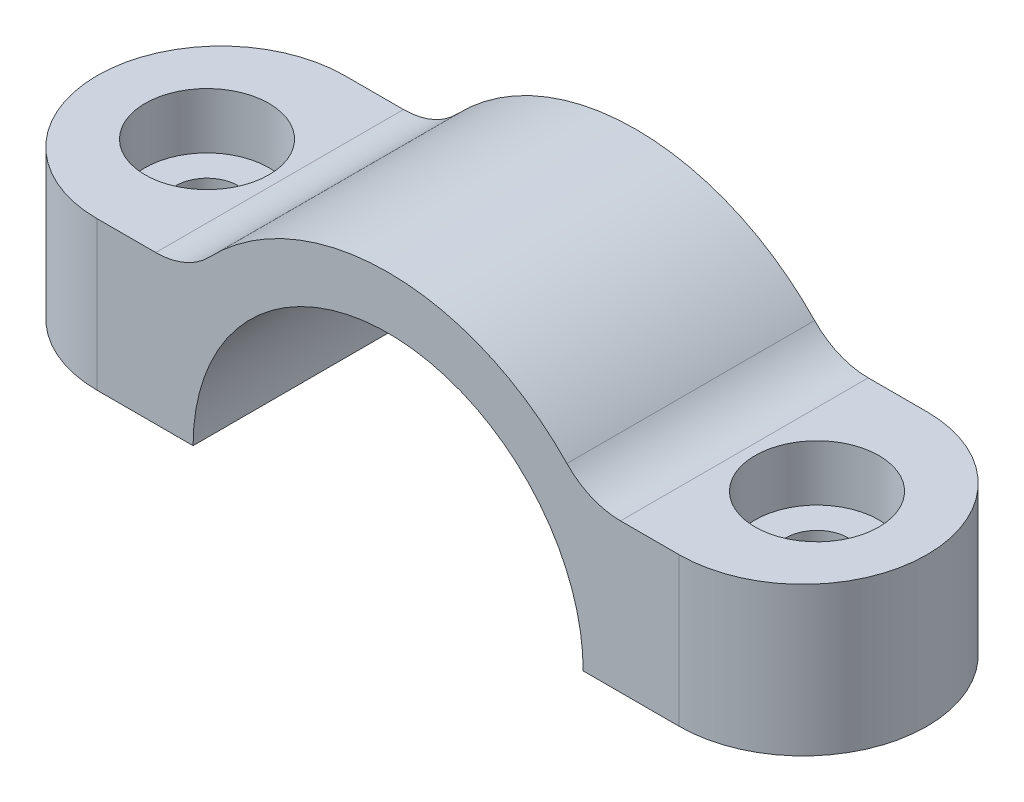
ISO-10303-21;
HEADER;
FILE_DESCRIPTION(('STEP AP214'),'2;1');
FILE_NAME('part.step','',(''),(''),'','','');
FILE_SCHEMA(('AUTOMOTIVE_DESIGN { 1 0 10303 214 1 1 1 1 }'));
ENDSEC;
DATA;
#1=APPLICATION_CONTEXT('core data for automotive mechanical design processes');
#2=APPLICATION_PROTOCOL_DEFINITION('international standard','automotive_design',2000,#1);
#3=PRODUCT_CONTEXT('',#1,'mechanical');
#4=PRODUCT('Part','Part','',(#3));
#5=PRODUCT_RELATED_PRODUCT_CATEGORY('part','',(#4));
#6=PRODUCT_DEFINITION_FORMATION('','',#4);
#7=PRODUCT_DEFINITION_CONTEXT('part definition',#1,'design');
#8=PRODUCT_DEFINITION('design','',#6,#7);
#9=PRODUCT_DEFINITION_SHAPE('','',#8);
#10=(LENGTH_UNIT() NAMED_UNIT(*) SI_UNIT(.MILLI.,.METRE.));
#11=(NAMED_UNIT(*) PLANE_ANGLE_UNIT() SI_UNIT($,.RADIAN.));
#12=(NAMED_UNIT(*) SI_UNIT($,.STERADIAN.) SOLID_ANGLE_UNIT());
#13=UNCERTAINTY_MEASURE_WITH_UNIT(LENGTH_MEASURE(1.E-05),#10,'distance_accuracy_value','');
#14=(GEOMETRIC_REPRESENTATION_CONTEXT(3) GLOBAL_UNCERTAINTY_ASSIGNED_CONTEXT((#13)) GLOBAL_UNIT_ASSIGNED_CONTEXT((#10,
#11,#12)) REPRESENTATION_CONTEXT('',''));
#15=CARTESIAN_POINT('',(0.,0.,0.));
#16=DIRECTION('',(0.,0.,1.));
#17=DIRECTION('',(1.,0.,0.));
#18=AXIS2_PLACEMENT_3D('',#15,#16,#17);
#19=CARTESIAN_POINT('',(0.,0.,12.7));
#20=DIRECTION('',(0.,0.,1.));
#21=DIRECTION('',(1.,0.,0.));
#22=AXIS2_PLACEMENT_3D('',#19,#20,#21);
#23=PLANE('',#22);
#24=DIRECTION('',(0.,-1.,0.));
#25=VECTOR('',#24,1.);
#26=CARTESIAN_POINT('',(-29.845,25.4,12.7));
#27=LINE('',#26,#25);
#28=CARTESIAN_POINT('',(-29.845,15.24,12.7));
#29=VERTEX_POINT('',#28);
#30=CARTESIAN_POINT('',(-29.845,0.,12.7));
#31=VERTEX_POINT('',#30);
#32=EDGE_CURVE('E112',#29,#31,#27,.T.);
#33=ORIENTED_EDGE('',*,*,#32,.T.);
#34=DIRECTION('',(1.,0.,0.));
#35=VECTOR('',#34,1.);
#36=CARTESIAN_POINT('',(-42.545,0.,12.7));
#37=LINE('',#36,#35);
#38=CARTESIAN_POINT('',(-20.,0.,12.7));
#39=VERTEX_POINT('',#38);
#40=EDGE_CURVE('E120',#31,#39,#37,.T.);
#41=ORIENTED_EDGE('',*,*,#40,.T.);
#42=CARTESIAN_POINT('',(0.,0.,12.7));
#43=DIRECTION('',(0.,0.,-1.));
#44=DIRECTION('',(1.,0.,0.));
#45=AXIS2_PLACEMENT_3D('',#42,#43,#44);
#46=CIRCLE('',#45,20.);
#47=CARTESIAN_POINT('',(20.,0.,12.7));
#48=VERTEX_POINT('',#47);
#49=EDGE_CURVE('E131',#39,#48,#46,.T.);
#50=ORIENTED_EDGE('',*,*,#49,.T.);
#51=DIRECTION('',(1.,0.,0.));
#52=VECTOR('',#51,1.);
#53=CARTESIAN_POINT('',(42.545,0.,12.7));
#54=LINE('',#53,#52);
#55=CARTESIAN_POINT('',(29.845,0.,12.7));
#56=VERTEX_POINT('',#55);
#57=EDGE_CURVE('E134',#48,#56,#54,.T.);
#58=ORIENTED_EDGE('',*,*,#57,.T.);
#59=DIRECTION('',(0.,-1.,0.));
#60=VECTOR('',#59,1.);
#61=CARTESIAN_POINT('',(29.845,25.4,12.7));
#62=LINE('',#61,#60);
#63=CARTESIAN_POINT('',(29.845,15.24,12.7));
#64=VERTEX_POINT('',#63);
#65=EDGE_CURVE('E125',#64,#56,#62,.T.);
#66=ORIENTED_EDGE('',*,*,#65,.F.);
#67=DIRECTION('',(-1.,0.,0.));
#68=VECTOR('',#67,1.);
#69=CARTESIAN_POINT('',(42.545,15.24,12.7));
#70=LINE('',#69,#68);
#71=CARTESIAN_POINT('',(23.827312059903,15.24,12.7));
#72=VERTEX_POINT('',#71);
#73=EDGE_CURVE('E145',#64,#72,#70,.T.);
#74=ORIENTED_EDGE('',*,*,#73,.T.);
#75=CARTESIAN_POINT('',(23.827312059903,22.86,12.7));
#76=DIRECTION('',(0.,0.,1.));
#77=DIRECTION('',(1.,0.,0.));
#78=AXIS2_PLACEMENT_3D('',#75,#76,#77);
#79=CIRCLE('',#78,7.62);
#80=CARTESIAN_POINT('',(18.3287015845408,17.5846153846154,12.7));
#81=VERTEX_POINT('',#80);
#82=EDGE_CURVE('E173',#72,#81,#79,.F.);
#83=ORIENTED_EDGE('',*,*,#82,.T.);
#84=CARTESIAN_POINT('',(0.,0.,12.7));
#85=DIRECTION('',(0.,0.,1.));
#86=DIRECTION('',(1.,0.,0.));
#87=AXIS2_PLACEMENT_3D('',#84,#85,#86);
#88=CIRCLE('',#87,25.4);
#89=CARTESIAN_POINT('',(-18.3287015845408,17.5846153846154,12.7));
#90=VERTEX_POINT('',#89);
#91=EDGE_CURVE('E147',#81,#90,#88,.T.);
#92=ORIENTED_EDGE('',*,*,#91,.T.);
#93=CARTESIAN_POINT('',(-23.827312059903,22.86,12.7));
#94=DIRECTION('',(0.,0.,1.));
#95=DIRECTION('',(1.,0.,0.));
#96=AXIS2_PLACEMENT_3D('',#93,#94,#95);
#97=CIRCLE('',#96,7.62);
#98=CARTESIAN_POINT('',(-23.827312059903,15.24,12.7));
#99=VERTEX_POINT('',#98);
#100=EDGE_CURVE('E12',#90,#99,#97,.F.);
#101=ORIENTED_EDGE('',*,*,#100,.T.);
#102=DIRECTION('',(-1.,0.,0.));
#103=VECTOR('',#102,1.);
#104=CARTESIAN_POINT('',(-42.545,15.24,12.7));
#105=LINE('',#104,#103);
#106=EDGE_CURVE('E123',#99,#29,#105,.T.);
#107=ORIENTED_EDGE('',*,*,#106,.T.);
#108=EDGE_LOOP('',(#33,#41,#50,#58,#66,#74,#83,#92,#101,#107));
#109=FACE_BOUND('',#108,.T.);
#110=ADVANCED_FACE('F35',(#109),#23,.T.);
#111=CARTESIAN_POINT('',(0.,0.,-12.7));
#112=DIRECTION('',(0.,0.,1.));
#113=DIRECTION('',(1.,0.,0.));
#114=AXIS2_PLACEMENT_3D('',#111,#112,#113);
#115=PLANE('',#114);
#116=DIRECTION('',(1.,0.,0.));
#117=VECTOR('',#116,1.);
#118=CARTESIAN_POINT('',(-42.545,0.,-12.7));
#119=LINE('',#118,#117);
#120=CARTESIAN_POINT('',(-29.845,0.,-12.7));
#121=VERTEX_POINT('',#120);
#122=CARTESIAN_POINT('',(-20.,0.,-12.7));
#123=VERTEX_POINT('',#122);
#124=EDGE_CURVE('E151',#121,#123,#119,.T.);
#125=ORIENTED_EDGE('',*,*,#124,.F.);
#126=DIRECTION('',(0.,-1.,0.));
#127=VECTOR('',#126,1.);
#128=CARTESIAN_POINT('',(-29.845,25.4,-12.7));
#129=LINE('',#128,#127);
#130=CARTESIAN_POINT('',(-29.845,15.24,-12.7));
#131=VERTEX_POINT('',#130);
#132=EDGE_CURVE('E114',#131,#121,#129,.T.);
#133=ORIENTED_EDGE('',*,*,#132,.F.);
#134=DIRECTION('',(-1.,0.,0.));
#135=VECTOR('',#134,1.);
#136=CARTESIAN_POINT('',(-42.545,15.24,-12.7));
#137=LINE('',#136,#135);
#138=CARTESIAN_POINT('',(-23.827312059903,15.24,-12.7));
#139=VERTEX_POINT('',#138);
#140=EDGE_CURVE('E132',#139,#131,#137,.T.);
#141=ORIENTED_EDGE('',*,*,#140,.F.);
#142=CARTESIAN_POINT('',(-23.827312059903,22.86,-12.7));
#143=DIRECTION('',(0.,0.,1.));
#144=DIRECTION('',(1.,0.,0.));
#145=AXIS2_PLACEMENT_3D('',#142,#143,#144);
#146=CIRCLE('',#145,7.62);
#147=CARTESIAN_POINT('',(-18.3287015845408,17.5846153846154,-12.7));
#148=VERTEX_POINT('',#147);
#149=EDGE_CURVE('E43',#139,#148,#146,.T.);
#150=ORIENTED_EDGE('',*,*,#149,.T.);
#151=CARTESIAN_POINT('',(0.,0.,-12.7));
#152=DIRECTION('',(0.,0.,1.));
#153=DIRECTION('',(1.,0.,0.));
#154=AXIS2_PLACEMENT_3D('',#151,#152,#153);
#155=CIRCLE('',#154,25.4);
#156=CARTESIAN_POINT('',(18.3287015845408,17.5846153846154,-12.7));
#157=VERTEX_POINT('',#156);
#158=EDGE_CURVE('E137',#157,#148,#155,.T.);
#159=ORIENTED_EDGE('',*,*,#158,.F.);
#160=CARTESIAN_POINT('',(23.827312059903,22.86,-12.7));
#161=DIRECTION('',(0.,0.,1.));
#162=DIRECTION('',(1.,0.,0.));
#163=AXIS2_PLACEMENT_3D('',#160,#161,#162);
#164=CIRCLE('',#163,7.62);
#165=CARTESIAN_POINT('',(23.827312059903,15.24,-12.7));
#166=VERTEX_POINT('',#165);
#167=EDGE_CURVE('E170',#157,#166,#164,.T.);
#168=ORIENTED_EDGE('',*,*,#167,.T.);
#169=DIRECTION('',(-1.,0.,0.));
#170=VECTOR('',#169,1.);
#171=CARTESIAN_POINT('',(42.545,15.24,-12.7));
#172=LINE('',#171,#170);
#173=CARTESIAN_POINT('',(29.845,15.24,-12.7));
#174=VERTEX_POINT('',#173);
#175=EDGE_CURVE('E158',#174,#166,#172,.T.);
#176=ORIENTED_EDGE('',*,*,#175,.F.);
#177=DIRECTION('',(0.,-1.,0.));
#178=VECTOR('',#177,1.);
#179=CARTESIAN_POINT('',(29.845,25.4,-12.7));
#180=LINE('',#179,#178);
#181=CARTESIAN_POINT('',(29.845,0.,-12.7));
#182=VERTEX_POINT('',#181);
#183=EDGE_CURVE('E199',#174,#182,#180,.T.);
#184=ORIENTED_EDGE('',*,*,#183,.T.);
#185=DIRECTION('',(1.,0.,0.));
#186=VECTOR('',#185,1.);
#187=CARTESIAN_POINT('',(42.545,0.,-12.7));
#188=LINE('',#187,#186);
#189=CARTESIAN_POINT('',(20.,0.,-12.7));
#190=VERTEX_POINT('',#189);
#191=EDGE_CURVE('E155',#190,#182,#188,.T.);
#192=ORIENTED_EDGE('',*,*,#191,.F.);
#193=CARTESIAN_POINT('',(0.,0.,-12.7));
#194=DIRECTION('',(0.,0.,-1.));
#195=DIRECTION('',(1.,0.,0.));
#196=AXIS2_PLACEMENT_3D('',#193,#194,#195);
#197=CIRCLE('',#196,20.);
#198=EDGE_CURVE('E153',#123,#190,#197,.T.);
#199=ORIENTED_EDGE('',*,*,#198,.F.);
#200=EDGE_LOOP('',(#125,#133,#141,#150,#159,#168,#176,#184,#192,#199));
#201=FACE_BOUND('',#200,.T.);
#202=ADVANCED_FACE('F185',(#201),#115,.F.);
#203=CARTESIAN_POINT('',(42.545,15.24,12.7));
#204=DIRECTION('',(0.,-1.,0.));
#205=DIRECTION('',(1.,0.,0.));
#206=AXIS2_PLACEMENT_3D('',#203,#204,#205);
#207=PLANE('',#206);
#208=ORIENTED_EDGE('',*,*,#73,.F.);
#209=CARTESIAN_POINT('',(29.845,15.24,0.));
#210=DIRECTION('',(0.,-1.,0.));
#211=DIRECTION('',(1.,0.,0.));
#212=AXIS2_PLACEMENT_3D('',#209,#210,#211);
#213=CIRCLE('',#212,12.7);
#214=EDGE_CURVE('E124',#64,#174,#213,.F.);
#215=ORIENTED_EDGE('',*,*,#214,.T.);
#216=ORIENTED_EDGE('',*,*,#175,.T.);
#217=DIRECTION('',(0.,0.,1.));
#218=VECTOR('',#217,1.);
#219=CARTESIAN_POINT('',(23.827312059903,15.24,12.7));
#220=LINE('',#219,#218);
#221=EDGE_CURVE('E167',#166,#72,#220,.T.);
#222=ORIENTED_EDGE('',*,*,#221,.T.);
#223=EDGE_LOOP('',(#208,#215,#216,#222));
#224=FACE_BOUND('',#223,.T.);
#225=CARTESIAN_POINT('',(31.2725,15.24,0.));
#226=DIRECTION('',(0.,-1.,0.));
#227=DIRECTION('',(1.,0.,0.));
#228=AXIS2_PLACEMENT_3D('',#225,#226,#227);
#229=CIRCLE('',#228,6.35);
#230=CARTESIAN_POINT('',(37.6225,15.24,0.));
#231=VERTEX_POINT('',#230);
#232=EDGE_CURVE('E207',#231,#231,#229,.T.);
#233=ORIENTED_EDGE('',*,*,#232,.T.);
#234=EDGE_LOOP('',(#233));
#235=FACE_BOUND('',#234,.T.);
#236=ADVANCED_FACE('F203',(#224,#235),#207,.F.);
#237=CARTESIAN_POINT('',(42.545,0.,12.7));
#238=DIRECTION('',(0.,1.,0.));
#239=DIRECTION('',(0.,0.,1.));
#240=AXIS2_PLACEMENT_3D('',#237,#238,#239);
#241=PLANE('',#240);
#242=ORIENTED_EDGE('',*,*,#191,.T.);
#243=CARTESIAN_POINT('',(29.845,0.,0.));
#244=DIRECTION('',(0.,1.,0.));
#245=DIRECTION('',(0.,0.,-1.));
#246=AXIS2_PLACEMENT_3D('',#243,#244,#245);
#247=CIRCLE('',#246,12.7);
#248=EDGE_CURVE('E50',#56,#182,#247,.T.);
#249=ORIENTED_EDGE('',*,*,#248,.F.);
#250=ORIENTED_EDGE('',*,*,#57,.F.);
#251=DIRECTION('',(0.,0.,-1.));
#252=VECTOR('',#251,1.);
#253=CARTESIAN_POINT('',(20.,0.,12.7));
#254=LINE('',#253,#252);
#255=EDGE_CURVE('E150',#48,#190,#254,.T.);
#256=ORIENTED_EDGE('',*,*,#255,.T.);
#257=EDGE_LOOP('',(#242,#249,#250,#256));
#258=FACE_BOUND('',#257,.T.);
#259=CARTESIAN_POINT('',(31.2725,0.,0.));
#260=DIRECTION('',(0.,1.,0.));
#261=DIRECTION('',(0.,0.,-1.));
#262=AXIS2_PLACEMENT_3D('',#259,#260,#261);
#263=CIRCLE('',#262,3.175);
#264=CARTESIAN_POINT('',(31.2725,0.,-3.175));
#265=VERTEX_POINT('',#264);
#266=EDGE_CURVE('E217',#265,#265,#263,.T.);
#267=ORIENTED_EDGE('',*,*,#266,.T.);
#268=EDGE_LOOP('',(#267));
#269=FACE_BOUND('',#268,.T.);
#270=ADVANCED_FACE('F238',(#258,#269),#241,.F.);
#271=CARTESIAN_POINT('',(-42.545,0.,12.7));
#272=DIRECTION('',(0.,1.,0.));
#273=DIRECTION('',(0.,0.,1.));
#274=AXIS2_PLACEMENT_3D('',#271,#272,#273);
#275=PLANE('',#274);
#276=CARTESIAN_POINT('',(-31.2725,0.,0.));
#277=DIRECTION('',(0.,-1.,0.));
#278=DIRECTION('',(0.,0.,-1.));
#279=AXIS2_PLACEMENT_3D('',#276,#277,#278);
#280=CIRCLE('',#279,3.175);
#281=CARTESIAN_POINT('',(-31.2725,0.,-3.175));
#282=VERTEX_POINT('',#281);
#283=EDGE_CURVE('E140',#282,#282,#280,.T.);
#284=ORIENTED_EDGE('',*,*,#283,.F.);
#285=EDGE_LOOP('',(#284));
#286=FACE_BOUND('',#285,.T.);
#287=ORIENTED_EDGE('',*,*,#40,.F.);
#288=CARTESIAN_POINT('',(-29.845,0.,0.));
#289=DIRECTION('',(0.,1.,0.));
#290=DIRECTION('',(0.,0.,1.));
#291=AXIS2_PLACEMENT_3D('',#288,#289,#290);
#292=CIRCLE('',#291,12.7);
#293=EDGE_CURVE('E109',#121,#31,#292,.T.);
#294=ORIENTED_EDGE('',*,*,#293,.F.);
#295=ORIENTED_EDGE('',*,*,#124,.T.);
#296=DIRECTION('',(0.,0.,-1.));
#297=VECTOR('',#296,1.);
#298=CARTESIAN_POINT('',(-20.,0.,12.7));
#299=LINE('',#298,#297);
#300=EDGE_CURVE('E130',#39,#123,#299,.T.);
#301=ORIENTED_EDGE('',*,*,#300,.F.);
#302=EDGE_LOOP('',(#287,#294,#295,#301));
#303=FACE_BOUND('',#302,.T.);
#304=ADVANCED_FACE('F128',(#286,#303),#275,.F.);
#305=CARTESIAN_POINT('',(0.,0.,12.7));
#306=DIRECTION('',(0.,0.,-1.));
#307=DIRECTION('',(-1.,0.,0.));
#308=AXIS2_PLACEMENT_3D('',#305,#306,#307);
#309=CYLINDRICAL_SURFACE('',#308,20.);
#310=ORIENTED_EDGE('',*,*,#198,.T.);
#311=ORIENTED_EDGE('',*,*,#255,.F.);
#312=ORIENTED_EDGE('',*,*,#49,.F.);
#313=ORIENTED_EDGE('',*,*,#300,.T.);
#314=EDGE_LOOP('',(#310,#311,#312,#313));
#315=FACE_BOUND('',#314,.T.);
#316=ADVANCED_FACE('F237',(#315),#309,.F.);
#317=CARTESIAN_POINT('',(0.,0.,12.7));
#318=DIRECTION('',(0.,0.,-1.));
#319=DIRECTION('',(-1.,0.,0.));
#320=AXIS2_PLACEMENT_3D('',#317,#318,#319);
#321=CYLINDRICAL_SURFACE('',#320,25.4);
#322=ORIENTED_EDGE('',*,*,#158,.T.);
#323=DIRECTION('',(0.,0.,-1.));
#324=VECTOR('',#323,1.);
#325=CARTESIAN_POINT('',(-18.3287015845408,17.5846153846154,12.7));
#326=LINE('',#325,#324);
#327=EDGE_CURVE('E178',#148,#90,#326,.F.);
#328=ORIENTED_EDGE('',*,*,#327,.T.);
#329=ORIENTED_EDGE('',*,*,#91,.F.);
#330=DIRECTION('',(0.,0.,-1.));
#331=VECTOR('',#330,1.);
#332=CARTESIAN_POINT('',(18.3287015845408,17.5846153846154,12.7));
#333=LINE('',#332,#331);
#334=EDGE_CURVE('E164',#81,#157,#333,.T.);
#335=ORIENTED_EDGE('',*,*,#334,.T.);
#336=EDGE_LOOP('',(#322,#328,#329,#335));
#337=FACE_BOUND('',#336,.T.);
#338=ADVANCED_FACE('F191',(#337),#321,.T.);
#339=CARTESIAN_POINT('',(-42.545,15.24,12.7));
#340=DIRECTION('',(0.,-1.,0.));
#341=DIRECTION('',(1.,0.,0.));
#342=AXIS2_PLACEMENT_3D('',#339,#340,#341);
#343=PLANE('',#342);
#344=CARTESIAN_POINT('',(-31.2725,15.24,0.));
#345=DIRECTION('',(0.,-1.,0.));
#346=DIRECTION('',(1.,0.,0.));
#347=AXIS2_PLACEMENT_3D('',#344,#345,#346);
#348=CIRCLE('',#347,6.35);
#349=CARTESIAN_POINT('',(-24.9225,15.24,0.));
#350=VERTEX_POINT('',#349);
#351=EDGE_CURVE('E225',#350,#350,#348,.F.);
#352=ORIENTED_EDGE('',*,*,#351,.F.);
#353=EDGE_LOOP('',(#352));
#354=FACE_BOUND('',#353,.T.);
#355=ORIENTED_EDGE('',*,*,#140,.T.);
#356=CARTESIAN_POINT('',(-29.845,15.24,0.));
#357=DIRECTION('',(0.,-1.,0.));
#358=DIRECTION('',(1.,0.,0.));
#359=AXIS2_PLACEMENT_3D('',#356,#357,#358);
#360=CIRCLE('',#359,12.7);
#361=EDGE_CURVE('E58',#131,#29,#360,.F.);
#362=ORIENTED_EDGE('',*,*,#361,.T.);
#363=ORIENTED_EDGE('',*,*,#106,.F.);
#364=DIRECTION('',(0.,0.,1.));
#365=VECTOR('',#364,1.);
#366=CARTESIAN_POINT('',(-23.827312059903,15.24,-12.7));
#367=LINE('',#366,#365);
#368=EDGE_CURVE('E175',#99,#139,#367,.F.);
#369=ORIENTED_EDGE('',*,*,#368,.T.);
#370=EDGE_LOOP('',(#355,#362,#363,#369));
#371=FACE_BOUND('',#370,.T.);
#372=ADVANCED_FACE('F257',(#354,#371),#343,.F.);
#373=CARTESIAN_POINT('',(23.827312059903,22.86,12.7));
#374=DIRECTION('',(0.,0.,-1.));
#375=DIRECTION('',(-1.,0.,0.));
#376=AXIS2_PLACEMENT_3D('',#373,#374,#375);
#377=CYLINDRICAL_SURFACE('',#376,7.62);
#378=ORIENTED_EDGE('',*,*,#82,.F.);
#379=ORIENTED_EDGE('',*,*,#221,.F.);
#380=ORIENTED_EDGE('',*,*,#167,.F.);
#381=ORIENTED_EDGE('',*,*,#334,.F.);
#382=EDGE_LOOP('',(#378,#379,#380,#381));
#383=FACE_BOUND('',#382,.T.);
#384=ADVANCED_FACE('F195',(#383),#377,.F.);
#385=CARTESIAN_POINT('',(-23.827312059903,22.86,12.7));
#386=DIRECTION('',(0.,0.,-1.));
#387=DIRECTION('',(-1.,0.,0.));
#388=AXIS2_PLACEMENT_3D('',#385,#386,#387);
#389=CYLINDRICAL_SURFACE('',#388,7.62);
#390=ORIENTED_EDGE('',*,*,#100,.F.);
#391=ORIENTED_EDGE('',*,*,#327,.F.);
#392=ORIENTED_EDGE('',*,*,#149,.F.);
#393=ORIENTED_EDGE('',*,*,#368,.F.);
#394=EDGE_LOOP('',(#390,#391,#392,#393));
#395=FACE_BOUND('',#394,.T.);
#396=ADVANCED_FACE('F37',(#395),#389,.F.);
#397=CARTESIAN_POINT('',(-31.2725,9.525,0.));
#398=DIRECTION('',(0.,-1.,0.));
#399=DIRECTION('',(0.,0.,-1.));
#400=AXIS2_PLACEMENT_3D('',#397,#398,#399);
#401=CYLINDRICAL_SURFACE('',#400,3.175);
#402=CARTESIAN_POINT('',(-31.2725,9.525,0.));
#403=DIRECTION('',(0.,-1.,0.));
#404=DIRECTION('',(0.,0.,-1.));
#405=AXIS2_PLACEMENT_3D('',#402,#403,#404);
#406=CIRCLE('',#405,3.175);
#407=CARTESIAN_POINT('',(-31.2725,9.525,-3.175));
#408=VERTEX_POINT('',#407);
#409=EDGE_CURVE('E227',#408,#408,#406,.F.);
#410=ORIENTED_EDGE('',*,*,#409,.T.);
#411=EDGE_LOOP('',(#410));
#412=FACE_BOUND('',#411,.T.);
#413=ORIENTED_EDGE('',*,*,#283,.T.);
#414=EDGE_LOOP('',(#413));
#415=FACE_BOUND('',#414,.T.);
#416=ADVANCED_FACE('F234',(#412,#415),#401,.F.);
#417=CARTESIAN_POINT('',(-31.2725,9.525,0.));
#418=DIRECTION('',(0.,-1.,0.));
#419=DIRECTION('',(0.,0.,-1.));
#420=AXIS2_PLACEMENT_3D('',#417,#418,#419);
#421=PLANE('',#420);
#422=CARTESIAN_POINT('',(-31.2725,9.525,0.));
#423=DIRECTION('',(0.,-1.,0.));
#424=DIRECTION('',(0.,0.,-1.));
#425=AXIS2_PLACEMENT_3D('',#422,#423,#424);
#426=CIRCLE('',#425,6.35);
#427=CARTESIAN_POINT('',(-31.2725,9.525,-6.35000000000001));
#428=VERTEX_POINT('',#427);
#429=EDGE_CURVE('E222',#428,#428,#426,.T.);
#430=ORIENTED_EDGE('',*,*,#429,.F.);
#431=EDGE_LOOP('',(#430));
#432=FACE_BOUND('',#431,.T.);
#433=ORIENTED_EDGE('',*,*,#409,.F.);
#434=EDGE_LOOP('',(#433));
#435=FACE_BOUND('',#434,.T.);
#436=ADVANCED_FACE('F329',(#432,#435),#421,.F.);
#437=CARTESIAN_POINT('',(-31.2725,25.401,0.));
#438=DIRECTION('',(0.,-1.,0.));
#439=DIRECTION('',(0.,0.,-1.));
#440=AXIS2_PLACEMENT_3D('',#437,#438,#439);
#441=CYLINDRICAL_SURFACE('',#440,6.35);
#442=ORIENTED_EDGE('',*,*,#429,.T.);
#443=EDGE_LOOP('',(#442));
#444=FACE_BOUND('',#443,.T.);
#445=ORIENTED_EDGE('',*,*,#351,.T.);
#446=EDGE_LOOP('',(#445));
#447=FACE_BOUND('',#446,.T.);
#448=ADVANCED_FACE('F327',(#444,#447),#441,.F.);
#449=CARTESIAN_POINT('',(31.2725,9.525,0.));
#450=DIRECTION('',(0.,-1.,0.));
#451=DIRECTION('',(0.,0.,-1.));
#452=AXIS2_PLACEMENT_3D('',#449,#450,#451);
#453=CYLINDRICAL_SURFACE('',#452,3.175);
#454=CARTESIAN_POINT('',(31.2725,9.525,0.));
#455=DIRECTION('',(0.,-1.,0.));
#456=DIRECTION('',(0.,0.,-1.));
#457=AXIS2_PLACEMENT_3D('',#454,#455,#456);
#458=CIRCLE('',#457,3.175);
#459=CARTESIAN_POINT('',(31.2725,9.525,-3.175));
#460=VERTEX_POINT('',#459);
#461=EDGE_CURVE('E214',#460,#460,#458,.F.);
#462=ORIENTED_EDGE('',*,*,#461,.T.);
#463=EDGE_LOOP('',(#462));
#464=FACE_BOUND('',#463,.T.);
#465=ORIENTED_EDGE('',*,*,#266,.F.);
#466=EDGE_LOOP('',(#465));
#467=FACE_BOUND('',#466,.T.);
#468=ADVANCED_FACE('F323',(#464,#467),#453,.F.);
#469=CARTESIAN_POINT('',(31.2725,25.401,0.));
#470=DIRECTION('',(0.,-1.,0.));
#471=DIRECTION('',(0.,0.,-1.));
#472=AXIS2_PLACEMENT_3D('',#469,#470,#471);
#473=CYLINDRICAL_SURFACE('',#472,6.35);
#474=CARTESIAN_POINT('',(31.2725,9.525,0.));
#475=DIRECTION('',(0.,1.,0.));
#476=DIRECTION('',(0.,0.,-1.));
#477=AXIS2_PLACEMENT_3D('',#474,#475,#476);
#478=CIRCLE('',#477,6.35);
#479=CARTESIAN_POINT('',(31.2725,9.525,-6.35000000000001));
#480=VERTEX_POINT('',#479);
#481=EDGE_CURVE('E211',#480,#480,#478,.T.);
#482=ORIENTED_EDGE('',*,*,#481,.F.);
#483=EDGE_LOOP('',(#482));
#484=FACE_BOUND('',#483,.T.);
#485=ORIENTED_EDGE('',*,*,#232,.F.);
#486=EDGE_LOOP('',(#485));
#487=FACE_BOUND('',#486,.T.);
#488=ADVANCED_FACE('F319',(#484,#487),#473,.F.);
#489=CARTESIAN_POINT('',(31.2725,9.525,0.));
#490=DIRECTION('',(0.,-1.,0.));
#491=DIRECTION('',(0.,0.,-1.));
#492=AXIS2_PLACEMENT_3D('',#489,#490,#491);
#493=PLANE('',#492);
#494=ORIENTED_EDGE('',*,*,#461,.F.);
#495=EDGE_LOOP('',(#494));
#496=FACE_BOUND('',#495,.T.);
#497=ORIENTED_EDGE('',*,*,#481,.T.);
#498=EDGE_LOOP('',(#497));
#499=FACE_BOUND('',#498,.T.);
#500=ADVANCED_FACE('F303',(#496,#499),#493,.F.);
#501=CARTESIAN_POINT('',(29.845,25.4,0.));
#502=DIRECTION('',(0.,-1.,0.));
#503=DIRECTION('',(0.,0.,-1.));
#504=AXIS2_PLACEMENT_3D('',#501,#502,#503);
#505=CYLINDRICAL_SURFACE('',#504,12.7);
#506=ORIENTED_EDGE('',*,*,#214,.F.);
#507=ORIENTED_EDGE('',*,*,#65,.T.);
#508=ORIENTED_EDGE('',*,*,#248,.T.);
#509=ORIENTED_EDGE('',*,*,#183,.F.);
#510=EDGE_LOOP('',(#506,#507,#508,#509));
#511=FACE_BOUND('',#510,.T.);
#512=ADVANCED_FACE('F298',(#511),#505,.T.);
#513=CARTESIAN_POINT('',(-29.845,25.4,0.));
#514=DIRECTION('',(0.,-1.,0.));
#515=DIRECTION('',(0.,0.,-1.));
#516=AXIS2_PLACEMENT_3D('',#513,#514,#515);
#517=CYLINDRICAL_SURFACE('',#516,12.7);
#518=ORIENTED_EDGE('',*,*,#132,.T.);
#519=ORIENTED_EDGE('',*,*,#293,.T.);
#520=ORIENTED_EDGE('',*,*,#32,.F.);
#521=ORIENTED_EDGE('',*,*,#361,.F.);
#522=EDGE_LOOP('',(#518,#519,#520,#521));
#523=FACE_BOUND('',#522,.T.);
#524=ADVANCED_FACE('F111',(#523),#517,.T.);
#525=CLOSED_SHELL('',(#110,#202,#236,#270,#304,#316,#338,#372,#384,#396,#416,#436,#448,#468,
#488,#500,#512,#524));
#526=MANIFOLD_SOLID_BREP('B2',#525);
#527=ADVANCED_BREP_SHAPE_REPRESENTATION('',(#18,#526),#14);
#528=SHAPE_DEFINITION_REPRESENTATION(#9,#527);
ENDSEC;
END-ISO-10303-21;
